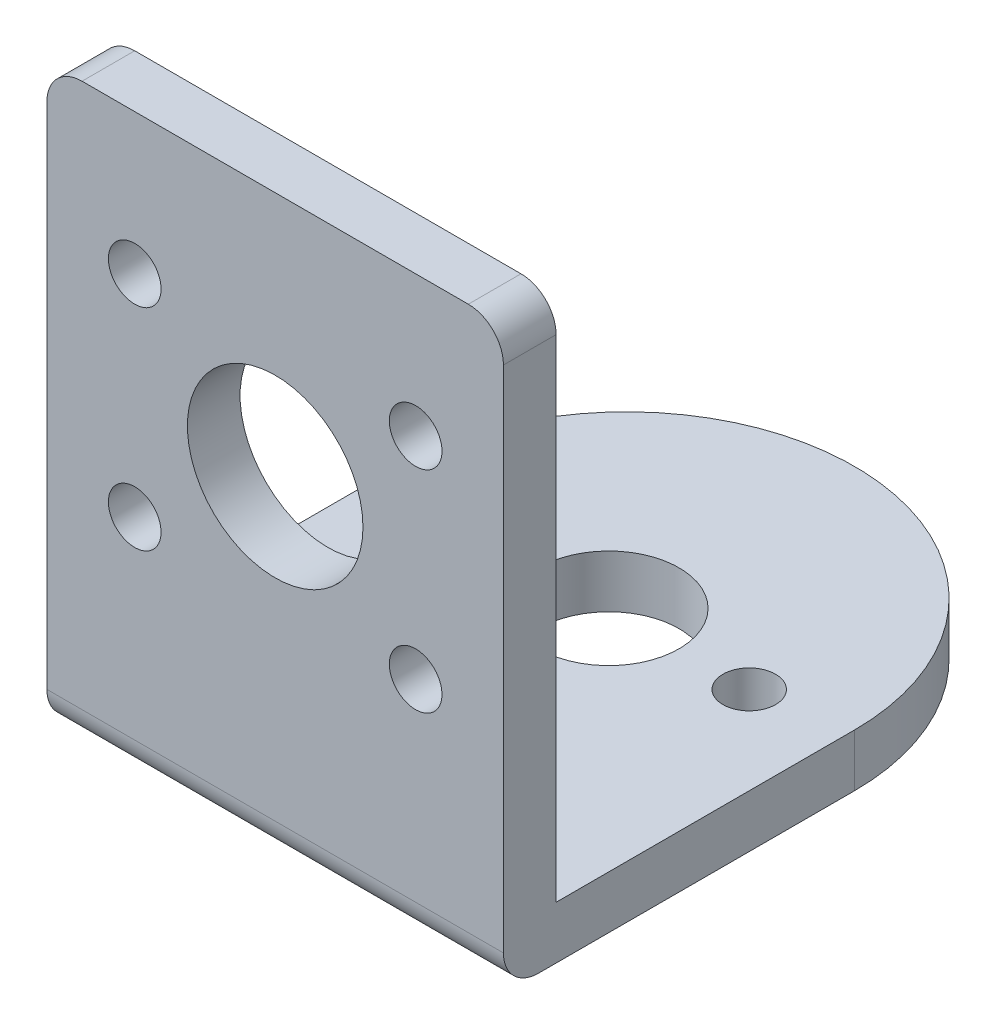
ISO-10303-21;
HEADER;
FILE_DESCRIPTION(('STEP AP214'),'2;1');
FILE_NAME('part.step','',(''),(''),'','','');
FILE_SCHEMA(('AUTOMOTIVE_DESIGN { 1 0 10303 214 1 1 1 1 }'));
ENDSEC;
DATA;
#1=APPLICATION_CONTEXT('core data for automotive mechanical design processes');
#2=APPLICATION_PROTOCOL_DEFINITION('international standard','automotive_design',2000,#1);
#3=PRODUCT_CONTEXT('',#1,'mechanical');
#4=PRODUCT('Part','Part','',(#3));
#5=PRODUCT_RELATED_PRODUCT_CATEGORY('part','',(#4));
#6=PRODUCT_DEFINITION_FORMATION('','',#4);
#7=PRODUCT_DEFINITION_CONTEXT('part definition',#1,'design');
#8=PRODUCT_DEFINITION('design','',#6,#7);
#9=PRODUCT_DEFINITION_SHAPE('','',#8);
#10=(LENGTH_UNIT() NAMED_UNIT(*) SI_UNIT(.MILLI.,.METRE.));
#11=(NAMED_UNIT(*) PLANE_ANGLE_UNIT() SI_UNIT($,.RADIAN.));
#12=(NAMED_UNIT(*) SI_UNIT($,.STERADIAN.) SOLID_ANGLE_UNIT());
#13=UNCERTAINTY_MEASURE_WITH_UNIT(LENGTH_MEASURE(1.E-05),#10,'distance_accuracy_value','');
#14=(GEOMETRIC_REPRESENTATION_CONTEXT(3) GLOBAL_UNCERTAINTY_ASSIGNED_CONTEXT((#13)) GLOBAL_UNIT_ASSIGNED_CONTEXT((#10,
#11,#12)) REPRESENTATION_CONTEXT('',''));
#15=CARTESIAN_POINT('',(0.,0.,0.));
#16=DIRECTION('',(0.,0.,1.));
#17=DIRECTION('',(1.,0.,0.));
#18=AXIS2_PLACEMENT_3D('',#15,#16,#17);
#19=CARTESIAN_POINT('',(-13.,-16.5,3.));
#20=DIRECTION('',(0.,1.,0.));
#21=DIRECTION('',(0.,0.,1.));
#22=AXIS2_PLACEMENT_3D('',#19,#20,#21);
#23=PLANE('',#22);
#24=CARTESIAN_POINT('',(-8.00000000000001,-16.5,-16.));
#25=DIRECTION('',(0.,1.,0.));
#26=DIRECTION('',(0.,0.,1.));
#27=AXIS2_PLACEMENT_3D('',#24,#25,#26);
#28=CIRCLE('',#27,1.5);
#29=CARTESIAN_POINT('',(-8.00000000000001,-16.5,-14.5));
#30=VERTEX_POINT('',#29);
#31=EDGE_CURVE('E523',#30,#30,#28,.T.);
#32=ORIENTED_EDGE('',*,*,#31,.T.);
#33=EDGE_LOOP('',(#32));
#34=FACE_BOUND('',#33,.T.);
#35=CARTESIAN_POINT('',(0.,-16.5,-16.));
#36=DIRECTION('',(0.,1.,0.));
#37=DIRECTION('',(0.,0.,1.));
#38=AXIS2_PLACEMENT_3D('',#35,#36,#37);
#39=CIRCLE('',#38,4.);
#40=CARTESIAN_POINT('',(0.,-16.5,-12.));
#41=VERTEX_POINT('',#40);
#42=EDGE_CURVE('E508',#41,#41,#39,.T.);
#43=ORIENTED_EDGE('',*,*,#42,.T.);
#44=EDGE_LOOP('',(#43));
#45=FACE_BOUND('',#44,.T.);
#46=DIRECTION('',(0.,0.,-1.));
#47=VECTOR('',#46,1.);
#48=CARTESIAN_POINT('',(13.,-16.5,3.));
#49=LINE('',#48,#47);
#50=CARTESIAN_POINT('',(13.,-16.5,1.));
#51=VERTEX_POINT('',#50);
#52=CARTESIAN_POINT('',(13.,-16.5,-17.));
#53=VERTEX_POINT('',#52);
#54=EDGE_CURVE('E242',#51,#53,#49,.T.);
#55=ORIENTED_EDGE('',*,*,#54,.F.);
#56=DIRECTION('',(1.,0.,0.));
#57=VECTOR('',#56,1.);
#58=CARTESIAN_POINT('',(-13.,-16.5,1.));
#59=LINE('',#58,#57);
#60=CARTESIAN_POINT('',(-13.,-16.5,1.));
#61=VERTEX_POINT('',#60);
#62=EDGE_CURVE('E110',#51,#61,#59,.F.);
#63=ORIENTED_EDGE('',*,*,#62,.T.);
#64=DIRECTION('',(0.,0.,-1.));
#65=VECTOR('',#64,1.);
#66=CARTESIAN_POINT('',(-13.,-16.5,3.));
#67=LINE('',#66,#65);
#68=CARTESIAN_POINT('',(-13.,-16.5,-17.));
#69=VERTEX_POINT('',#68);
#70=EDGE_CURVE('E250',#61,#69,#67,.T.);
#71=ORIENTED_EDGE('',*,*,#70,.T.);
#72=CARTESIAN_POINT('',(0.,-16.5,-17.));
#73=DIRECTION('',(0.,1.,0.));
#74=DIRECTION('',(0.,0.,1.));
#75=AXIS2_PLACEMENT_3D('',#72,#73,#74);
#76=CIRCLE('',#75,13.);
#77=EDGE_CURVE('E183',#53,#69,#76,.T.);
#78=ORIENTED_EDGE('',*,*,#77,.F.);
#79=EDGE_LOOP('',(#55,#63,#71,#78));
#80=FACE_BOUND('',#79,.T.);
#81=CARTESIAN_POINT('',(7.99999999999999,-16.5,-16.));
#82=DIRECTION('',(0.,-1.,0.));
#83=DIRECTION('',(0.,0.,-1.));
#84=AXIS2_PLACEMENT_3D('',#81,#82,#83);
#85=CIRCLE('',#84,1.5);
#86=CARTESIAN_POINT('',(7.99999999999999,-16.5,-17.5));
#87=VERTEX_POINT('',#86);
#88=EDGE_CURVE('E515',#87,#87,#85,.T.);
#89=ORIENTED_EDGE('',*,*,#88,.F.);
#90=EDGE_LOOP('',(#89));
#91=FACE_BOUND('',#90,.T.);
#92=ADVANCED_FACE('F102',(#34,#45,#80,#91),#23,.F.);
#93=CARTESIAN_POINT('',(13.,-13.5,-30.));
#94=DIRECTION('',(0.,1.,0.));
#95=DIRECTION('',(0.,0.,1.));
#96=AXIS2_PLACEMENT_3D('',#93,#94,#95);
#97=PLANE('',#96);
#98=CARTESIAN_POINT('',(0.,-13.5,-17.));
#99=DIRECTION('',(0.,1.,0.));
#100=DIRECTION('',(0.,0.,1.));
#101=AXIS2_PLACEMENT_3D('',#98,#99,#100);
#102=CIRCLE('',#101,13.);
#103=CARTESIAN_POINT('',(13.,-13.5,-17.));
#104=VERTEX_POINT('',#103);
#105=CARTESIAN_POINT('',(-13.,-13.5,-17.));
#106=VERTEX_POINT('',#105);
#107=EDGE_CURVE('E171',#104,#106,#102,.T.);
#108=ORIENTED_EDGE('',*,*,#107,.T.);
#109=DIRECTION('',(0.,0.,1.));
#110=VECTOR('',#109,1.);
#111=CARTESIAN_POINT('',(-13.,-13.5,-30.));
#112=LINE('',#111,#110);
#113=CARTESIAN_POINT('',(-13.,-13.5,0.));
#114=VERTEX_POINT('',#113);
#115=EDGE_CURVE('E177',#106,#114,#112,.T.);
#116=ORIENTED_EDGE('',*,*,#115,.T.);
#117=DIRECTION('',(-1.,0.,0.));
#118=VECTOR('',#117,1.);
#119=CARTESIAN_POINT('',(13.,-13.5,0.));
#120=LINE('',#119,#118);
#121=CARTESIAN_POINT('',(13.,-13.5,0.));
#122=VERTEX_POINT('',#121);
#123=EDGE_CURVE('E197',#122,#114,#120,.T.);
#124=ORIENTED_EDGE('',*,*,#123,.F.);
#125=DIRECTION('',(0.,0.,1.));
#126=VECTOR('',#125,1.);
#127=CARTESIAN_POINT('',(13.,-13.5,-30.));
#128=LINE('',#127,#126);
#129=EDGE_CURVE('E179',#104,#122,#128,.T.);
#130=ORIENTED_EDGE('',*,*,#129,.F.);
#131=EDGE_LOOP('',(#108,#116,#124,#130));
#132=FACE_BOUND('',#131,.T.);
#133=CARTESIAN_POINT('',(0.,-13.5,-16.));
#134=DIRECTION('',(0.,1.,0.));
#135=DIRECTION('',(0.,0.,1.));
#136=AXIS2_PLACEMENT_3D('',#133,#134,#135);
#137=CIRCLE('',#136,4.);
#138=CARTESIAN_POINT('',(0.,-13.5,-12.));
#139=VERTEX_POINT('',#138);
#140=EDGE_CURVE('E191',#139,#139,#137,.T.);
#141=ORIENTED_EDGE('',*,*,#140,.F.);
#142=EDGE_LOOP('',(#141));
#143=FACE_BOUND('',#142,.T.);
#144=CARTESIAN_POINT('',(-8.00000000000001,-13.5,-16.));
#145=DIRECTION('',(0.,1.,0.));
#146=DIRECTION('',(0.,0.,1.));
#147=AXIS2_PLACEMENT_3D('',#144,#145,#146);
#148=CIRCLE('',#147,1.5);
#149=CARTESIAN_POINT('',(-8.00000000000001,-13.5,-14.5));
#150=VERTEX_POINT('',#149);
#151=EDGE_CURVE('E512',#150,#150,#148,.T.);
#152=ORIENTED_EDGE('',*,*,#151,.F.);
#153=EDGE_LOOP('',(#152));
#154=FACE_BOUND('',#153,.T.);
#155=CARTESIAN_POINT('',(7.99999999999999,-13.5,-16.));
#156=DIRECTION('',(0.,-1.,0.));
#157=DIRECTION('',(0.,0.,-1.));
#158=AXIS2_PLACEMENT_3D('',#155,#156,#157);
#159=CIRCLE('',#158,1.5);
#160=CARTESIAN_POINT('',(7.99999999999999,-13.5,-17.5));
#161=VERTEX_POINT('',#160);
#162=EDGE_CURVE('E521',#161,#161,#159,.T.);
#163=ORIENTED_EDGE('',*,*,#162,.T.);
#164=EDGE_LOOP('',(#163));
#165=FACE_BOUND('',#164,.T.);
#166=ADVANCED_FACE('F173',(#132,#143,#154,#165),#97,.T.);
#167=CARTESIAN_POINT('',(-13.,-16.5,3.));
#168=DIRECTION('',(1.,0.,0.));
#169=DIRECTION('',(0.,0.,-1.));
#170=AXIS2_PLACEMENT_3D('',#167,#168,#169);
#171=PLANE('',#170);
#172=ORIENTED_EDGE('',*,*,#70,.F.);
#173=CARTESIAN_POINT('',(-13.,-14.5,1.));
#174=DIRECTION('',(1.,0.,0.));
#175=DIRECTION('',(0.,0.,-1.));
#176=AXIS2_PLACEMENT_3D('',#173,#174,#175);
#177=CIRCLE('',#176,2.);
#178=CARTESIAN_POINT('',(-13.,-14.5,3.));
#179=VERTEX_POINT('',#178);
#180=EDGE_CURVE('E12',#61,#179,#177,.F.);
#181=ORIENTED_EDGE('',*,*,#180,.T.);
#182=DIRECTION('',(0.,-1.,0.));
#183=VECTOR('',#182,1.);
#184=CARTESIAN_POINT('',(-13.,-16.5,3.));
#185=LINE('',#184,#183);
#186=CARTESIAN_POINT('',(-13.,14.5,3.));
#187=VERTEX_POINT('',#186);
#188=EDGE_CURVE('E239',#187,#179,#185,.T.);
#189=ORIENTED_EDGE('',*,*,#188,.F.);
#190=DIRECTION('',(0.,0.,-1.));
#191=VECTOR('',#190,1.);
#192=CARTESIAN_POINT('',(-13.,14.5,3.));
#193=LINE('',#192,#191);
#194=CARTESIAN_POINT('',(-13.,14.5,0.));
#195=VERTEX_POINT('',#194);
#196=EDGE_CURVE('E268',#187,#195,#193,.T.);
#197=ORIENTED_EDGE('',*,*,#196,.T.);
#198=DIRECTION('',(0.,-1.,0.));
#199=VECTOR('',#198,1.);
#200=CARTESIAN_POINT('',(-13.,-16.5,0.));
#201=LINE('',#200,#199);
#202=EDGE_CURVE('E196',#195,#114,#201,.T.);
#203=ORIENTED_EDGE('',*,*,#202,.T.);
#204=ORIENTED_EDGE('',*,*,#115,.F.);
#205=DIRECTION('',(0.,1.,0.));
#206=VECTOR('',#205,1.);
#207=CARTESIAN_POINT('',(-13.,-16.5,-17.));
#208=LINE('',#207,#206);
#209=EDGE_CURVE('E184',#69,#106,#208,.T.);
#210=ORIENTED_EDGE('',*,*,#209,.F.);
#211=EDGE_LOOP('',(#172,#181,#189,#197,#203,#204,#210));
#212=FACE_BOUND('',#211,.T.);
#213=ADVANCED_FACE('F193',(#212),#171,.F.);
#214=CARTESIAN_POINT('',(0.,0.,0.));
#215=DIRECTION('',(0.,0.,-1.));
#216=DIRECTION('',(-1.,0.,0.));
#217=AXIS2_PLACEMENT_3D('',#214,#215,#216);
#218=PLANE('',#217);
#219=CARTESIAN_POINT('',(8.,-3.5,0.));
#220=DIRECTION('',(0.,0.,1.));
#221=DIRECTION('',(-1.,0.,0.));
#222=AXIS2_PLACEMENT_3D('',#219,#220,#221);
#223=CIRCLE('',#222,1.5);
#224=CARTESIAN_POINT('',(6.5,-3.5,0.));
#225=VERTEX_POINT('',#224);
#226=EDGE_CURVE('E207',#225,#225,#223,.T.);
#227=ORIENTED_EDGE('',*,*,#226,.T.);
#228=EDGE_LOOP('',(#227));
#229=FACE_BOUND('',#228,.T.);
#230=CARTESIAN_POINT('',(-8.,8.5,0.));
#231=DIRECTION('',(0.,0.,1.));
#232=DIRECTION('',(1.,0.,0.));
#233=AXIS2_PLACEMENT_3D('',#230,#231,#232);
#234=CIRCLE('',#233,1.5);
#235=CARTESIAN_POINT('',(-6.5,8.5,0.));
#236=VERTEX_POINT('',#235);
#237=EDGE_CURVE('E219',#236,#236,#234,.T.);
#238=ORIENTED_EDGE('',*,*,#237,.T.);
#239=EDGE_LOOP('',(#238));
#240=FACE_BOUND('',#239,.T.);
#241=CARTESIAN_POINT('',(0.,2.5,0.));
#242=DIRECTION('',(0.,0.,1.));
#243=DIRECTION('',(1.,0.,0.));
#244=AXIS2_PLACEMENT_3D('',#241,#242,#243);
#245=CIRCLE('',#244,5.);
#246=CARTESIAN_POINT('',(5.,2.5,0.));
#247=VERTEX_POINT('',#246);
#248=EDGE_CURVE('E225',#247,#247,#245,.T.);
#249=ORIENTED_EDGE('',*,*,#248,.T.);
#250=EDGE_LOOP('',(#249));
#251=FACE_BOUND('',#250,.T.);
#252=CARTESIAN_POINT('',(8.,8.5,0.));
#253=DIRECTION('',(0.,0.,1.));
#254=DIRECTION('',(1.,0.,0.));
#255=AXIS2_PLACEMENT_3D('',#252,#253,#254);
#256=CIRCLE('',#255,1.5);
#257=CARTESIAN_POINT('',(9.50000000000001,8.5,0.));
#258=VERTEX_POINT('',#257);
#259=EDGE_CURVE('E213',#258,#258,#256,.T.);
#260=ORIENTED_EDGE('',*,*,#259,.T.);
#261=EDGE_LOOP('',(#260));
#262=FACE_BOUND('',#261,.T.);
#263=CARTESIAN_POINT('',(-8.,-3.5,0.));
#264=DIRECTION('',(0.,0.,1.));
#265=DIRECTION('',(-1.,0.,0.));
#266=AXIS2_PLACEMENT_3D('',#263,#264,#265);
#267=CIRCLE('',#266,1.5);
#268=CARTESIAN_POINT('',(-9.5,-3.5,0.));
#269=VERTEX_POINT('',#268);
#270=EDGE_CURVE('E199',#269,#269,#267,.T.);
#271=ORIENTED_EDGE('',*,*,#270,.T.);
#272=EDGE_LOOP('',(#271));
#273=FACE_BOUND('',#272,.T.);
#274=DIRECTION('',(-1.,0.,0.));
#275=VECTOR('',#274,1.);
#276=CARTESIAN_POINT('',(-13.,16.5,0.));
#277=LINE('',#276,#275);
#278=CARTESIAN_POINT('',(11.,16.5,0.));
#279=VERTEX_POINT('',#278);
#280=CARTESIAN_POINT('',(-11.,16.5,0.));
#281=VERTEX_POINT('',#280);
#282=EDGE_CURVE('E245',#279,#281,#277,.T.);
#283=ORIENTED_EDGE('',*,*,#282,.F.);
#284=CARTESIAN_POINT('',(11.,14.5,0.));
#285=DIRECTION('',(0.,0.,-1.));
#286=DIRECTION('',(-1.,0.,0.));
#287=AXIS2_PLACEMENT_3D('',#284,#285,#286);
#288=CIRCLE('',#287,2.);
#289=CARTESIAN_POINT('',(13.,14.5,0.));
#290=VERTEX_POINT('',#289);
#291=EDGE_CURVE('E259',#279,#290,#288,.T.);
#292=ORIENTED_EDGE('',*,*,#291,.T.);
#293=DIRECTION('',(0.,1.,0.));
#294=VECTOR('',#293,1.);
#295=CARTESIAN_POINT('',(13.,-16.5,0.));
#296=LINE('',#295,#294);
#297=EDGE_CURVE('E231',#122,#290,#296,.T.);
#298=ORIENTED_EDGE('',*,*,#297,.F.);
#299=ORIENTED_EDGE('',*,*,#123,.T.);
#300=ORIENTED_EDGE('',*,*,#202,.F.);
#301=CARTESIAN_POINT('',(-11.,14.5,0.));
#302=DIRECTION('',(0.,0.,-1.));
#303=DIRECTION('',(-1.,0.,0.));
#304=AXIS2_PLACEMENT_3D('',#301,#302,#303);
#305=CIRCLE('',#304,2.);
#306=EDGE_CURVE('E257',#195,#281,#305,.T.);
#307=ORIENTED_EDGE('',*,*,#306,.T.);
#308=EDGE_LOOP('',(#283,#292,#298,#299,#300,#307));
#309=FACE_BOUND('',#308,.T.);
#310=ADVANCED_FACE('F311',(#229,#240,#251,#262,#273,#309),#218,.T.);
#311=CARTESIAN_POINT('',(0.,0.,3.));
#312=DIRECTION('',(0.,0.,-1.));
#313=DIRECTION('',(-1.,0.,0.));
#314=AXIS2_PLACEMENT_3D('',#311,#312,#313);
#315=PLANE('',#314);
#316=ORIENTED_EDGE('',*,*,#188,.T.);
#317=DIRECTION('',(1.,0.,0.));
#318=VECTOR('',#317,1.);
#319=CARTESIAN_POINT('',(0.,-14.5,3.));
#320=LINE('',#319,#318);
#321=CARTESIAN_POINT('',(13.,-14.5,3.));
#322=VERTEX_POINT('',#321);
#323=EDGE_CURVE('E270',#179,#322,#320,.T.);
#324=ORIENTED_EDGE('',*,*,#323,.T.);
#325=DIRECTION('',(0.,1.,0.));
#326=VECTOR('',#325,1.);
#327=CARTESIAN_POINT('',(13.,-16.5,3.));
#328=LINE('',#327,#326);
#329=CARTESIAN_POINT('',(13.,14.5,3.));
#330=VERTEX_POINT('',#329);
#331=EDGE_CURVE('E234',#322,#330,#328,.T.);
#332=ORIENTED_EDGE('',*,*,#331,.T.);
#333=CARTESIAN_POINT('',(11.,14.5,3.));
#334=DIRECTION('',(0.,0.,-1.));
#335=DIRECTION('',(-1.,0.,0.));
#336=AXIS2_PLACEMENT_3D('',#333,#334,#335);
#337=CIRCLE('',#336,2.);
#338=CARTESIAN_POINT('',(11.,16.5,3.));
#339=VERTEX_POINT('',#338);
#340=EDGE_CURVE('E266',#330,#339,#337,.F.);
#341=ORIENTED_EDGE('',*,*,#340,.T.);
#342=DIRECTION('',(-1.,0.,0.));
#343=VECTOR('',#342,1.);
#344=CARTESIAN_POINT('',(-13.,16.5,3.));
#345=LINE('',#344,#343);
#346=CARTESIAN_POINT('',(-11.,16.5,3.));
#347=VERTEX_POINT('',#346);
#348=EDGE_CURVE('E236',#339,#347,#345,.T.);
#349=ORIENTED_EDGE('',*,*,#348,.T.);
#350=CARTESIAN_POINT('',(-11.,14.5,3.));
#351=DIRECTION('',(0.,0.,-1.));
#352=DIRECTION('',(-1.,0.,0.));
#353=AXIS2_PLACEMENT_3D('',#350,#351,#352);
#354=CIRCLE('',#353,2.);
#355=EDGE_CURVE('E264',#347,#187,#354,.F.);
#356=ORIENTED_EDGE('',*,*,#355,.T.);
#357=EDGE_LOOP('',(#316,#324,#332,#341,#349,#356));
#358=FACE_BOUND('',#357,.T.);
#359=CARTESIAN_POINT('',(0.,2.5,3.));
#360=DIRECTION('',(0.,0.,1.));
#361=DIRECTION('',(1.,0.,0.));
#362=AXIS2_PLACEMENT_3D('',#359,#360,#361);
#363=CIRCLE('',#362,5.);
#364=CARTESIAN_POINT('',(5.,2.5,3.));
#365=VERTEX_POINT('',#364);
#366=EDGE_CURVE('E228',#365,#365,#363,.T.);
#367=ORIENTED_EDGE('',*,*,#366,.F.);
#368=EDGE_LOOP('',(#367));
#369=FACE_BOUND('',#368,.T.);
#370=CARTESIAN_POINT('',(-8.,8.5,3.));
#371=DIRECTION('',(0.,0.,1.));
#372=DIRECTION('',(1.,0.,0.));
#373=AXIS2_PLACEMENT_3D('',#370,#371,#372);
#374=CIRCLE('',#373,1.5);
#375=CARTESIAN_POINT('',(-6.5,8.5,3.));
#376=VERTEX_POINT('',#375);
#377=EDGE_CURVE('E222',#376,#376,#374,.T.);
#378=ORIENTED_EDGE('',*,*,#377,.F.);
#379=EDGE_LOOP('',(#378));
#380=FACE_BOUND('',#379,.T.);
#381=CARTESIAN_POINT('',(8.,8.5,3.));
#382=DIRECTION('',(0.,0.,1.));
#383=DIRECTION('',(1.,0.,0.));
#384=AXIS2_PLACEMENT_3D('',#381,#382,#383);
#385=CIRCLE('',#384,1.5);
#386=CARTESIAN_POINT('',(9.50000000000001,8.5,3.));
#387=VERTEX_POINT('',#386);
#388=EDGE_CURVE('E216',#387,#387,#385,.T.);
#389=ORIENTED_EDGE('',*,*,#388,.F.);
#390=EDGE_LOOP('',(#389));
#391=FACE_BOUND('',#390,.T.);
#392=CARTESIAN_POINT('',(8.,-3.5,3.));
#393=DIRECTION('',(0.,0.,1.));
#394=DIRECTION('',(-1.,0.,0.));
#395=AXIS2_PLACEMENT_3D('',#392,#393,#394);
#396=CIRCLE('',#395,1.5);
#397=CARTESIAN_POINT('',(6.5,-3.5,3.));
#398=VERTEX_POINT('',#397);
#399=EDGE_CURVE('E210',#398,#398,#396,.T.);
#400=ORIENTED_EDGE('',*,*,#399,.F.);
#401=EDGE_LOOP('',(#400));
#402=FACE_BOUND('',#401,.T.);
#403=CARTESIAN_POINT('',(-8.,-3.5,3.));
#404=DIRECTION('',(0.,0.,1.));
#405=DIRECTION('',(-1.,0.,0.));
#406=AXIS2_PLACEMENT_3D('',#403,#404,#405);
#407=CIRCLE('',#406,1.5);
#408=CARTESIAN_POINT('',(-9.5,-3.5,3.));
#409=VERTEX_POINT('',#408);
#410=EDGE_CURVE('E204',#409,#409,#407,.T.);
#411=ORIENTED_EDGE('',*,*,#410,.F.);
#412=EDGE_LOOP('',(#411));
#413=FACE_BOUND('',#412,.T.);
#414=ADVANCED_FACE('F275',(#358,#369,#380,#391,#402,#413),#315,.F.);
#415=CARTESIAN_POINT('',(13.,-16.5,3.));
#416=DIRECTION('',(-1.,0.,0.));
#417=DIRECTION('',(0.,0.,1.));
#418=AXIS2_PLACEMENT_3D('',#415,#416,#417);
#419=PLANE('',#418);
#420=ORIENTED_EDGE('',*,*,#331,.F.);
#421=CARTESIAN_POINT('',(13.,-14.5,1.));
#422=DIRECTION('',(-1.,0.,0.));
#423=DIRECTION('',(0.,0.,1.));
#424=AXIS2_PLACEMENT_3D('',#421,#422,#423);
#425=CIRCLE('',#424,2.);
#426=EDGE_CURVE('E124',#322,#51,#425,.F.);
#427=ORIENTED_EDGE('',*,*,#426,.T.);
#428=ORIENTED_EDGE('',*,*,#54,.T.);
#429=DIRECTION('',(0.,1.,0.));
#430=VECTOR('',#429,1.);
#431=CARTESIAN_POINT('',(13.,-16.5,-17.));
#432=LINE('',#431,#430);
#433=EDGE_CURVE('E201',#53,#104,#432,.T.);
#434=ORIENTED_EDGE('',*,*,#433,.T.);
#435=ORIENTED_EDGE('',*,*,#129,.T.);
#436=ORIENTED_EDGE('',*,*,#297,.T.);
#437=DIRECTION('',(0.,0.,-1.));
#438=VECTOR('',#437,1.);
#439=CARTESIAN_POINT('',(13.,14.5,3.));
#440=LINE('',#439,#438);
#441=EDGE_CURVE('E261',#290,#330,#440,.F.);
#442=ORIENTED_EDGE('',*,*,#441,.T.);
#443=EDGE_LOOP('',(#420,#427,#428,#434,#435,#436,#442));
#444=FACE_BOUND('',#443,.T.);
#445=ADVANCED_FACE('F280',(#444),#419,.F.);
#446=CARTESIAN_POINT('',(-13.,16.5,3.));
#447=DIRECTION('',(0.,-1.,0.));
#448=DIRECTION('',(0.,0.,-1.));
#449=AXIS2_PLACEMENT_3D('',#446,#447,#448);
#450=PLANE('',#449);
#451=ORIENTED_EDGE('',*,*,#348,.F.);
#452=DIRECTION('',(0.,0.,-1.));
#453=VECTOR('',#452,1.);
#454=CARTESIAN_POINT('',(11.,16.5,3.));
#455=LINE('',#454,#453);
#456=EDGE_CURVE('E254',#339,#279,#455,.T.);
#457=ORIENTED_EDGE('',*,*,#456,.T.);
#458=ORIENTED_EDGE('',*,*,#282,.T.);
#459=DIRECTION('',(0.,0.,-1.));
#460=VECTOR('',#459,1.);
#461=CARTESIAN_POINT('',(-11.,16.5,3.));
#462=LINE('',#461,#460);
#463=EDGE_CURVE('E252',#281,#347,#462,.F.);
#464=ORIENTED_EDGE('',*,*,#463,.T.);
#465=EDGE_LOOP('',(#451,#457,#458,#464));
#466=FACE_BOUND('',#465,.T.);
#467=ADVANCED_FACE('F290',(#466),#450,.F.);
#468=CARTESIAN_POINT('',(0.,2.5,3.));
#469=DIRECTION('',(0.,0.,-1.));
#470=DIRECTION('',(-1.,0.,0.));
#471=AXIS2_PLACEMENT_3D('',#468,#469,#470);
#472=CYLINDRICAL_SURFACE('',#471,5.);
#473=ORIENTED_EDGE('',*,*,#366,.T.);
#474=EDGE_LOOP('',(#473));
#475=FACE_BOUND('',#474,.T.);
#476=ORIENTED_EDGE('',*,*,#248,.F.);
#477=EDGE_LOOP('',(#476));
#478=FACE_BOUND('',#477,.T.);
#479=ADVANCED_FACE('F317',(#475,#478),#472,.F.);
#480=CARTESIAN_POINT('',(-8.,8.5,3.));
#481=DIRECTION('',(0.,0.,-1.));
#482=DIRECTION('',(-1.,0.,0.));
#483=AXIS2_PLACEMENT_3D('',#480,#481,#482);
#484=CYLINDRICAL_SURFACE('',#483,1.5);
#485=ORIENTED_EDGE('',*,*,#377,.T.);
#486=EDGE_LOOP('',(#485));
#487=FACE_BOUND('',#486,.T.);
#488=ORIENTED_EDGE('',*,*,#237,.F.);
#489=EDGE_LOOP('',(#488));
#490=FACE_BOUND('',#489,.T.);
#491=ADVANCED_FACE('F353',(#487,#490),#484,.F.);
#492=CARTESIAN_POINT('',(8.,8.5,3.));
#493=DIRECTION('',(0.,0.,-1.));
#494=DIRECTION('',(-1.,0.,0.));
#495=AXIS2_PLACEMENT_3D('',#492,#493,#494);
#496=CYLINDRICAL_SURFACE('',#495,1.5);
#497=ORIENTED_EDGE('',*,*,#388,.T.);
#498=EDGE_LOOP('',(#497));
#499=FACE_BOUND('',#498,.T.);
#500=ORIENTED_EDGE('',*,*,#259,.F.);
#501=EDGE_LOOP('',(#500));
#502=FACE_BOUND('',#501,.T.);
#503=ADVANCED_FACE('F349',(#499,#502),#496,.F.);
#504=CARTESIAN_POINT('',(8.,-3.5,3.));
#505=DIRECTION('',(0.,0.,-1.));
#506=DIRECTION('',(-1.,0.,0.));
#507=AXIS2_PLACEMENT_3D('',#504,#505,#506);
#508=CYLINDRICAL_SURFACE('',#507,1.5);
#509=ORIENTED_EDGE('',*,*,#399,.T.);
#510=EDGE_LOOP('',(#509));
#511=FACE_BOUND('',#510,.T.);
#512=ORIENTED_EDGE('',*,*,#226,.F.);
#513=EDGE_LOOP('',(#512));
#514=FACE_BOUND('',#513,.T.);
#515=ADVANCED_FACE('F345',(#511,#514),#508,.F.);
#516=CARTESIAN_POINT('',(-8.,-3.5,3.));
#517=DIRECTION('',(0.,0.,-1.));
#518=DIRECTION('',(-1.,0.,0.));
#519=AXIS2_PLACEMENT_3D('',#516,#517,#518);
#520=CYLINDRICAL_SURFACE('',#519,1.5);
#521=ORIENTED_EDGE('',*,*,#410,.T.);
#522=EDGE_LOOP('',(#521));
#523=FACE_BOUND('',#522,.T.);
#524=ORIENTED_EDGE('',*,*,#270,.F.);
#525=EDGE_LOOP('',(#524));
#526=FACE_BOUND('',#525,.T.);
#527=ADVANCED_FACE('F341',(#523,#526),#520,.F.);
#528=CARTESIAN_POINT('',(0.,-16.5,-17.));
#529=DIRECTION('',(0.,1.,0.));
#530=DIRECTION('',(0.,0.,1.));
#531=AXIS2_PLACEMENT_3D('',#528,#529,#530);
#532=CYLINDRICAL_SURFACE('',#531,13.);
#533=ORIENTED_EDGE('',*,*,#107,.F.);
#534=ORIENTED_EDGE('',*,*,#433,.F.);
#535=ORIENTED_EDGE('',*,*,#77,.T.);
#536=ORIENTED_EDGE('',*,*,#209,.T.);
#537=EDGE_LOOP('',(#533,#534,#535,#536));
#538=FACE_BOUND('',#537,.T.);
#539=ADVANCED_FACE('F188',(#538),#532,.T.);
#540=CARTESIAN_POINT('',(0.,-16.5,-16.));
#541=DIRECTION('',(0.,1.,0.));
#542=DIRECTION('',(0.,0.,1.));
#543=AXIS2_PLACEMENT_3D('',#540,#541,#542);
#544=CYLINDRICAL_SURFACE('',#543,4.);
#545=ORIENTED_EDGE('',*,*,#42,.F.);
#546=EDGE_LOOP('',(#545));
#547=FACE_BOUND('',#546,.T.);
#548=ORIENTED_EDGE('',*,*,#140,.T.);
#549=EDGE_LOOP('',(#548));
#550=FACE_BOUND('',#549,.T.);
#551=ADVANCED_FACE('F331',(#547,#550),#544,.F.);
#552=CARTESIAN_POINT('',(-8.00000000000001,-16.5,-16.));
#553=DIRECTION('',(0.,1.,0.));
#554=DIRECTION('',(0.,0.,1.));
#555=AXIS2_PLACEMENT_3D('',#552,#553,#554);
#556=CYLINDRICAL_SURFACE('',#555,1.5);
#557=ORIENTED_EDGE('',*,*,#31,.F.);
#558=EDGE_LOOP('',(#557));
#559=FACE_BOUND('',#558,.T.);
#560=ORIENTED_EDGE('',*,*,#151,.T.);
#561=EDGE_LOOP('',(#560));
#562=FACE_BOUND('',#561,.T.);
#563=ADVANCED_FACE('F325',(#559,#562),#556,.F.);
#564=CARTESIAN_POINT('',(7.99999999999999,-16.5,-16.));
#565=DIRECTION('',(0.,1.,0.));
#566=DIRECTION('',(0.,0.,1.));
#567=AXIS2_PLACEMENT_3D('',#564,#565,#566);
#568=CYLINDRICAL_SURFACE('',#567,1.5);
#569=ORIENTED_EDGE('',*,*,#88,.T.);
#570=EDGE_LOOP('',(#569));
#571=FACE_BOUND('',#570,.T.);
#572=ORIENTED_EDGE('',*,*,#162,.F.);
#573=EDGE_LOOP('',(#572));
#574=FACE_BOUND('',#573,.T.);
#575=ADVANCED_FACE('F321',(#571,#574),#568,.F.);
#576=CARTESIAN_POINT('',(11.,14.5,3.));
#577=DIRECTION('',(0.,0.,-1.));
#578=DIRECTION('',(-1.,0.,0.));
#579=AXIS2_PLACEMENT_3D('',#576,#577,#578);
#580=CYLINDRICAL_SURFACE('',#579,2.);
#581=ORIENTED_EDGE('',*,*,#340,.F.);
#582=ORIENTED_EDGE('',*,*,#441,.F.);
#583=ORIENTED_EDGE('',*,*,#291,.F.);
#584=ORIENTED_EDGE('',*,*,#456,.F.);
#585=EDGE_LOOP('',(#581,#582,#583,#584));
#586=FACE_BOUND('',#585,.T.);
#587=ADVANCED_FACE('F286',(#586),#580,.T.);
#588=CARTESIAN_POINT('',(-11.,14.5,3.));
#589=DIRECTION('',(0.,0.,-1.));
#590=DIRECTION('',(-1.,0.,0.));
#591=AXIS2_PLACEMENT_3D('',#588,#589,#590);
#592=CYLINDRICAL_SURFACE('',#591,2.);
#593=ORIENTED_EDGE('',*,*,#355,.F.);
#594=ORIENTED_EDGE('',*,*,#463,.F.);
#595=ORIENTED_EDGE('',*,*,#306,.F.);
#596=ORIENTED_EDGE('',*,*,#196,.F.);
#597=EDGE_LOOP('',(#593,#594,#595,#596));
#598=FACE_BOUND('',#597,.T.);
#599=ADVANCED_FACE('F294',(#598),#592,.T.);
#600=CARTESIAN_POINT('',(0.,-14.5,1.));
#601=DIRECTION('',(1.,0.,0.));
#602=DIRECTION('',(0.,0.,-1.));
#603=AXIS2_PLACEMENT_3D('',#600,#601,#602);
#604=CYLINDRICAL_SURFACE('',#603,2.);
#605=ORIENTED_EDGE('',*,*,#180,.F.);
#606=ORIENTED_EDGE('',*,*,#62,.F.);
#607=ORIENTED_EDGE('',*,*,#426,.F.);
#608=ORIENTED_EDGE('',*,*,#323,.F.);
#609=EDGE_LOOP('',(#605,#606,#607,#608));
#610=FACE_BOUND('',#609,.T.);
#611=ADVANCED_FACE('F104',(#610),#604,.T.);
#612=CLOSED_SHELL('',(#92,#166,#213,#310,#414,#445,#467,#479,#491,#503,#515,#527,#539,#551,#563,
#575,#587,#599,#611));
#613=MANIFOLD_SOLID_BREP('B2',#612);
#614=ADVANCED_BREP_SHAPE_REPRESENTATION('',(#18,#613),#14);
#615=SHAPE_DEFINITION_REPRESENTATION(#9,#614);
ENDSEC;
END-ISO-10303-21;
